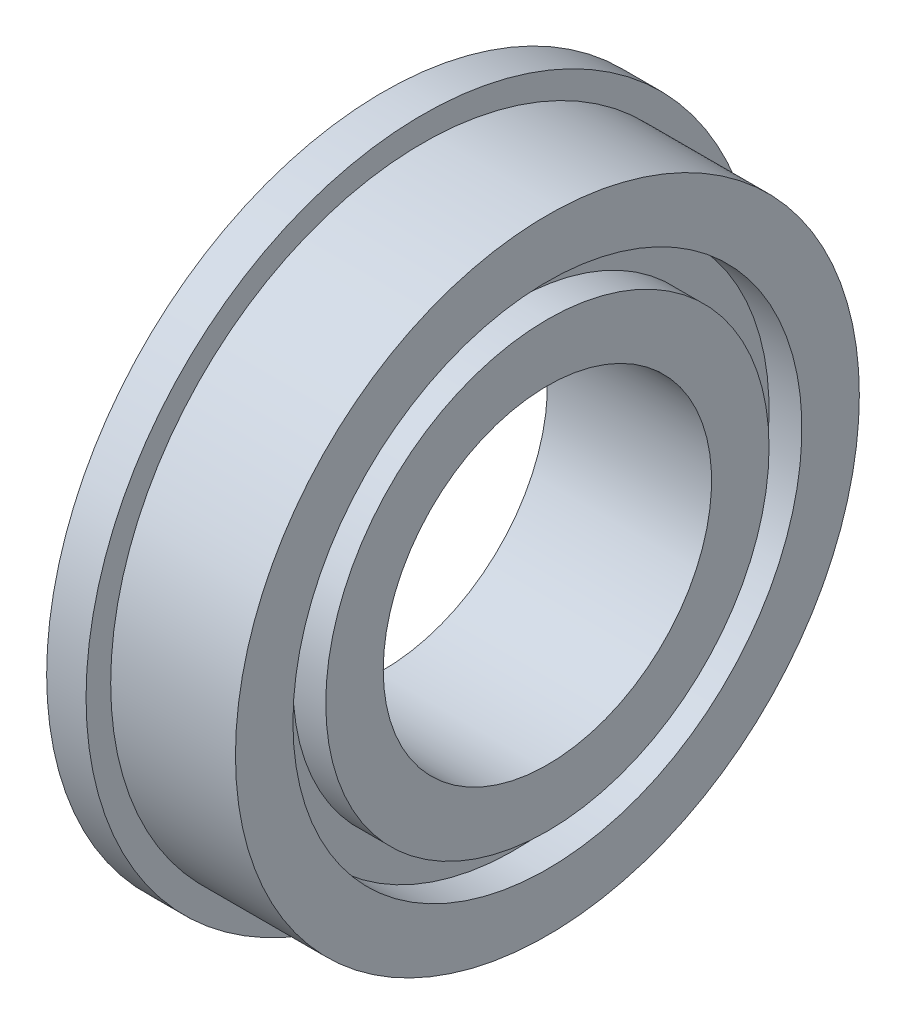
ISO-10303-21;
HEADER;
FILE_DESCRIPTION(('STEP AP214'),'2;1');
FILE_NAME('part.step','',(''),(''),'','','');
FILE_SCHEMA(('AUTOMOTIVE_DESIGN { 1 0 10303 214 1 1 1 1 }'));
ENDSEC;
DATA;
#1=APPLICATION_CONTEXT('core data for automotive mechanical design processes');
#2=APPLICATION_PROTOCOL_DEFINITION('international standard','automotive_design',2000,#1);
#3=PRODUCT_CONTEXT('',#1,'mechanical');
#4=PRODUCT('Part','Part','',(#3));
#5=PRODUCT_RELATED_PRODUCT_CATEGORY('part','',(#4));
#6=PRODUCT_DEFINITION_FORMATION('','',#4);
#7=PRODUCT_DEFINITION_CONTEXT('part definition',#1,'design');
#8=PRODUCT_DEFINITION('design','',#6,#7);
#9=PRODUCT_DEFINITION_SHAPE('','',#8);
#10=(LENGTH_UNIT() NAMED_UNIT(*) SI_UNIT(.MILLI.,.METRE.));
#11=(NAMED_UNIT(*) PLANE_ANGLE_UNIT() SI_UNIT($,.RADIAN.));
#12=(NAMED_UNIT(*) SI_UNIT($,.STERADIAN.) SOLID_ANGLE_UNIT());
#13=UNCERTAINTY_MEASURE_WITH_UNIT(LENGTH_MEASURE(1.E-05),#10,'distance_accuracy_value','');
#14=(GEOMETRIC_REPRESENTATION_CONTEXT(3) GLOBAL_UNCERTAINTY_ASSIGNED_CONTEXT((#13)) GLOBAL_UNIT_ASSIGNED_CONTEXT((#10,
#11,#12)) REPRESENTATION_CONTEXT('',''));
#15=CARTESIAN_POINT('',(0.,0.,0.));
#16=DIRECTION('',(0.,0.,1.));
#17=DIRECTION('',(1.,0.,0.));
#18=AXIS2_PLACEMENT_3D('',#15,#16,#17);
#19=CARTESIAN_POINT('',(-1.2,10.25,0.));
#20=DIRECTION('',(1.,0.,0.));
#21=DIRECTION('',(0.,0.,-1.));
#22=AXIS2_PLACEMENT_3D('',#19,#20,#21);
#23=PLANE('',#22);
#24=CARTESIAN_POINT('',(-1.2,0.,0.));
#25=DIRECTION('',(-1.,0.,0.));
#26=DIRECTION('',(0.,0.,1.));
#27=AXIS2_PLACEMENT_3D('',#24,#25,#26);
#28=CIRCLE('',#27,7.75);
#29=CARTESIAN_POINT('',(-1.2,0.,7.75));
#30=VERTEX_POINT('',#29);
#31=EDGE_CURVE('E10',#30,#30,#28,.T.);
#32=ORIENTED_EDGE('',*,*,#31,.F.);
#33=EDGE_LOOP('',(#32));
#34=FACE_BOUND('',#33,.T.);
#35=CARTESIAN_POINT('',(-1.2,0.,0.));
#36=DIRECTION('',(-1.,0.,0.));
#37=DIRECTION('',(0.,0.,1.));
#38=AXIS2_PLACEMENT_3D('',#35,#36,#37);
#39=CIRCLE('',#38,10.25);
#40=CARTESIAN_POINT('',(-1.2,0.,10.25));
#41=VERTEX_POINT('',#40);
#42=EDGE_CURVE('E75',#41,#41,#39,.T.);
#43=ORIENTED_EDGE('',*,*,#42,.T.);
#44=EDGE_LOOP('',(#43));
#45=FACE_BOUND('',#44,.T.);
#46=ADVANCED_FACE('F29',(#34,#45),#23,.F.);
#47=CARTESIAN_POINT('',(0.,0.,0.));
#48=DIRECTION('',(-1.,0.,0.));
#49=DIRECTION('',(0.,0.,1.));
#50=AXIS2_PLACEMENT_3D('',#47,#48,#49);
#51=CYLINDRICAL_SURFACE('',#50,7.75);
#52=CARTESIAN_POINT('',(-0.199999999999999,0.,0.));
#53=DIRECTION('',(-1.,0.,0.));
#54=DIRECTION('',(0.,0.,1.));
#55=AXIS2_PLACEMENT_3D('',#52,#53,#54);
#56=CIRCLE('',#55,7.75);
#57=CARTESIAN_POINT('',(-0.199999999999999,0.,7.75));
#58=VERTEX_POINT('',#57);
#59=EDGE_CURVE('E35',#58,#58,#56,.T.);
#60=ORIENTED_EDGE('',*,*,#59,.F.);
#61=EDGE_LOOP('',(#60));
#62=FACE_BOUND('',#61,.T.);
#63=ORIENTED_EDGE('',*,*,#31,.T.);
#64=EDGE_LOOP('',(#63));
#65=FACE_BOUND('',#64,.T.);
#66=ADVANCED_FACE('F148',(#62,#65),#51,.F.);
#67=CARTESIAN_POINT('',(-0.199999999999999,6.75,0.));
#68=DIRECTION('',(1.,0.,0.));
#69=DIRECTION('',(0.,0.,-1.));
#70=AXIS2_PLACEMENT_3D('',#67,#68,#69);
#71=PLANE('',#70);
#72=CARTESIAN_POINT('',(-0.199999999999999,0.,0.));
#73=DIRECTION('',(-1.,0.,0.));
#74=DIRECTION('',(0.,0.,1.));
#75=AXIS2_PLACEMENT_3D('',#72,#73,#74);
#76=CIRCLE('',#75,6.75);
#77=CARTESIAN_POINT('',(-0.199999999999999,0.,6.75));
#78=VERTEX_POINT('',#77);
#79=EDGE_CURVE('E39',#78,#78,#76,.T.);
#80=ORIENTED_EDGE('',*,*,#79,.F.);
#81=EDGE_LOOP('',(#80));
#82=FACE_BOUND('',#81,.T.);
#83=ORIENTED_EDGE('',*,*,#59,.T.);
#84=EDGE_LOOP('',(#83));
#85=FACE_BOUND('',#84,.T.);
#86=ADVANCED_FACE('F143',(#82,#85),#71,.F.);
#87=CARTESIAN_POINT('',(0.,0.,0.));
#88=DIRECTION('',(-1.,0.,0.));
#89=DIRECTION('',(0.,0.,1.));
#90=AXIS2_PLACEMENT_3D('',#87,#88,#89);
#91=CYLINDRICAL_SURFACE('',#90,6.75);
#92=CARTESIAN_POINT('',(-1.2,0.,0.));
#93=DIRECTION('',(-1.,0.,0.));
#94=DIRECTION('',(0.,0.,1.));
#95=AXIS2_PLACEMENT_3D('',#92,#93,#94);
#96=CIRCLE('',#95,6.75);
#97=CARTESIAN_POINT('',(-1.2,0.,6.75));
#98=VERTEX_POINT('',#97);
#99=EDGE_CURVE('E43',#98,#98,#96,.T.);
#100=ORIENTED_EDGE('',*,*,#99,.F.);
#101=EDGE_LOOP('',(#100));
#102=FACE_BOUND('',#101,.T.);
#103=ORIENTED_EDGE('',*,*,#79,.T.);
#104=EDGE_LOOP('',(#103));
#105=FACE_BOUND('',#104,.T.);
#106=ADVANCED_FACE('F137',(#102,#105),#91,.T.);
#107=CARTESIAN_POINT('',(-1.2,6.75,0.));
#108=DIRECTION('',(1.,0.,0.));
#109=DIRECTION('',(0.,0.,-1.));
#110=AXIS2_PLACEMENT_3D('',#107,#108,#109);
#111=PLANE('',#110);
#112=CARTESIAN_POINT('',(-1.2,0.,0.));
#113=DIRECTION('',(-1.,0.,0.));
#114=DIRECTION('',(0.,0.,1.));
#115=AXIS2_PLACEMENT_3D('',#112,#113,#114);
#116=CIRCLE('',#115,5.);
#117=CARTESIAN_POINT('',(-1.2,0.,5.));
#118=VERTEX_POINT('',#117);
#119=EDGE_CURVE('E48',#118,#118,#116,.T.);
#120=ORIENTED_EDGE('',*,*,#119,.F.);
#121=EDGE_LOOP('',(#120));
#122=FACE_BOUND('',#121,.T.);
#123=ORIENTED_EDGE('',*,*,#99,.T.);
#124=EDGE_LOOP('',(#123));
#125=FACE_BOUND('',#124,.T.);
#126=ADVANCED_FACE('F131',(#122,#125),#111,.F.);
#127=CARTESIAN_POINT('',(0.,0.,0.));
#128=DIRECTION('',(-1.,0.,0.));
#129=DIRECTION('',(0.,0.,1.));
#130=AXIS2_PLACEMENT_3D('',#127,#128,#129);
#131=CYLINDRICAL_SURFACE('',#130,5.);
#132=CARTESIAN_POINT('',(3.8,0.,0.));
#133=DIRECTION('',(-1.,0.,0.));
#134=DIRECTION('',(0.,0.,1.));
#135=AXIS2_PLACEMENT_3D('',#132,#133,#134);
#136=CIRCLE('',#135,5.);
#137=CARTESIAN_POINT('',(3.8,0.,5.));
#138=VERTEX_POINT('',#137);
#139=EDGE_CURVE('E51',#138,#138,#136,.T.);
#140=ORIENTED_EDGE('',*,*,#139,.F.);
#141=EDGE_LOOP('',(#140));
#142=FACE_BOUND('',#141,.T.);
#143=ORIENTED_EDGE('',*,*,#119,.T.);
#144=EDGE_LOOP('',(#143));
#145=FACE_BOUND('',#144,.T.);
#146=ADVANCED_FACE('F125',(#142,#145),#131,.F.);
#147=CARTESIAN_POINT('',(3.8,6.75,0.));
#148=DIRECTION('',(-1.,0.,0.));
#149=DIRECTION('',(0.,0.,1.));
#150=AXIS2_PLACEMENT_3D('',#147,#148,#149);
#151=PLANE('',#150);
#152=CARTESIAN_POINT('',(3.8,0.,0.));
#153=DIRECTION('',(-1.,0.,0.));
#154=DIRECTION('',(0.,0.,1.));
#155=AXIS2_PLACEMENT_3D('',#152,#153,#154);
#156=CIRCLE('',#155,6.75);
#157=CARTESIAN_POINT('',(3.8,0.,6.75));
#158=VERTEX_POINT('',#157);
#159=EDGE_CURVE('E54',#158,#158,#156,.T.);
#160=ORIENTED_EDGE('',*,*,#159,.F.);
#161=EDGE_LOOP('',(#160));
#162=FACE_BOUND('',#161,.T.);
#163=ORIENTED_EDGE('',*,*,#139,.T.);
#164=EDGE_LOOP('',(#163));
#165=FACE_BOUND('',#164,.T.);
#166=ADVANCED_FACE('F119',(#162,#165),#151,.F.);
#167=CARTESIAN_POINT('',(0.,0.,0.));
#168=DIRECTION('',(-1.,0.,0.));
#169=DIRECTION('',(0.,0.,1.));
#170=AXIS2_PLACEMENT_3D('',#167,#168,#169);
#171=CYLINDRICAL_SURFACE('',#170,6.75);
#172=CARTESIAN_POINT('',(2.8,0.,0.));
#173=DIRECTION('',(-1.,0.,0.));
#174=DIRECTION('',(0.,0.,1.));
#175=AXIS2_PLACEMENT_3D('',#172,#173,#174);
#176=CIRCLE('',#175,6.75);
#177=CARTESIAN_POINT('',(2.8,0.,6.75));
#178=VERTEX_POINT('',#177);
#179=EDGE_CURVE('E57',#178,#178,#176,.T.);
#180=ORIENTED_EDGE('',*,*,#179,.F.);
#181=EDGE_LOOP('',(#180));
#182=FACE_BOUND('',#181,.T.);
#183=ORIENTED_EDGE('',*,*,#159,.T.);
#184=EDGE_LOOP('',(#183));
#185=FACE_BOUND('',#184,.T.);
#186=ADVANCED_FACE('F113',(#182,#185),#171,.T.);
#187=CARTESIAN_POINT('',(2.8,7.75,0.));
#188=DIRECTION('',(-1.,0.,0.));
#189=DIRECTION('',(0.,0.,1.));
#190=AXIS2_PLACEMENT_3D('',#187,#188,#189);
#191=PLANE('',#190);
#192=CARTESIAN_POINT('',(2.8,0.,0.));
#193=DIRECTION('',(-1.,0.,0.));
#194=DIRECTION('',(0.,0.,1.));
#195=AXIS2_PLACEMENT_3D('',#192,#193,#194);
#196=CIRCLE('',#195,7.75);
#197=CARTESIAN_POINT('',(2.8,0.,7.75));
#198=VERTEX_POINT('',#197);
#199=EDGE_CURVE('E60',#198,#198,#196,.T.);
#200=ORIENTED_EDGE('',*,*,#199,.F.);
#201=EDGE_LOOP('',(#200));
#202=FACE_BOUND('',#201,.T.);
#203=ORIENTED_EDGE('',*,*,#179,.T.);
#204=EDGE_LOOP('',(#203));
#205=FACE_BOUND('',#204,.T.);
#206=ADVANCED_FACE('F107',(#202,#205),#191,.F.);
#207=CARTESIAN_POINT('',(0.,0.,0.));
#208=DIRECTION('',(-1.,0.,0.));
#209=DIRECTION('',(0.,0.,1.));
#210=AXIS2_PLACEMENT_3D('',#207,#208,#209);
#211=CYLINDRICAL_SURFACE('',#210,7.75);
#212=CARTESIAN_POINT('',(3.8,0.,0.));
#213=DIRECTION('',(-1.,0.,0.));
#214=DIRECTION('',(0.,0.,1.));
#215=AXIS2_PLACEMENT_3D('',#212,#213,#214);
#216=CIRCLE('',#215,7.75);
#217=CARTESIAN_POINT('',(3.8,0.,7.75));
#218=VERTEX_POINT('',#217);
#219=EDGE_CURVE('E63',#218,#218,#216,.T.);
#220=ORIENTED_EDGE('',*,*,#219,.F.);
#221=EDGE_LOOP('',(#220));
#222=FACE_BOUND('',#221,.T.);
#223=ORIENTED_EDGE('',*,*,#199,.T.);
#224=EDGE_LOOP('',(#223));
#225=FACE_BOUND('',#224,.T.);
#226=ADVANCED_FACE('F101',(#222,#225),#211,.F.);
#227=CARTESIAN_POINT('',(3.8,9.5,0.));
#228=DIRECTION('',(-1.,0.,0.));
#229=DIRECTION('',(0.,0.,1.));
#230=AXIS2_PLACEMENT_3D('',#227,#228,#229);
#231=PLANE('',#230);
#232=CARTESIAN_POINT('',(3.8,0.,0.));
#233=DIRECTION('',(-1.,0.,0.));
#234=DIRECTION('',(0.,0.,1.));
#235=AXIS2_PLACEMENT_3D('',#232,#233,#234);
#236=CIRCLE('',#235,9.5);
#237=CARTESIAN_POINT('',(3.8,0.,9.5));
#238=VERTEX_POINT('',#237);
#239=EDGE_CURVE('E66',#238,#238,#236,.T.);
#240=ORIENTED_EDGE('',*,*,#239,.F.);
#241=EDGE_LOOP('',(#240));
#242=FACE_BOUND('',#241,.T.);
#243=ORIENTED_EDGE('',*,*,#219,.T.);
#244=EDGE_LOOP('',(#243));
#245=FACE_BOUND('',#244,.T.);
#246=ADVANCED_FACE('F95',(#242,#245),#231,.F.);
#247=CARTESIAN_POINT('',(0.,0.,0.));
#248=DIRECTION('',(-1.,0.,0.));
#249=DIRECTION('',(0.,0.,1.));
#250=AXIS2_PLACEMENT_3D('',#247,#248,#249);
#251=CYLINDRICAL_SURFACE('',#250,9.5);
#252=CARTESIAN_POINT('',(0.,0.,0.));
#253=DIRECTION('',(-1.,0.,0.));
#254=DIRECTION('',(0.,0.,1.));
#255=AXIS2_PLACEMENT_3D('',#252,#253,#254);
#256=CIRCLE('',#255,9.5);
#257=CARTESIAN_POINT('',(0.,0.,9.5));
#258=VERTEX_POINT('',#257);
#259=EDGE_CURVE('E69',#258,#258,#256,.T.);
#260=ORIENTED_EDGE('',*,*,#259,.F.);
#261=EDGE_LOOP('',(#260));
#262=FACE_BOUND('',#261,.T.);
#263=ORIENTED_EDGE('',*,*,#239,.T.);
#264=EDGE_LOOP('',(#263));
#265=FACE_BOUND('',#264,.T.);
#266=ADVANCED_FACE('F89',(#262,#265),#251,.T.);
#267=CARTESIAN_POINT('',(0.,10.25,0.));
#268=DIRECTION('',(-1.,0.,0.));
#269=DIRECTION('',(0.,0.,1.));
#270=AXIS2_PLACEMENT_3D('',#267,#268,#269);
#271=PLANE('',#270);
#272=CARTESIAN_POINT('',(0.,0.,0.));
#273=DIRECTION('',(-1.,0.,0.));
#274=DIRECTION('',(0.,0.,1.));
#275=AXIS2_PLACEMENT_3D('',#272,#273,#274);
#276=CIRCLE('',#275,10.25);
#277=CARTESIAN_POINT('',(0.,0.,10.25));
#278=VERTEX_POINT('',#277);
#279=EDGE_CURVE('E72',#278,#278,#276,.T.);
#280=ORIENTED_EDGE('',*,*,#279,.F.);
#281=EDGE_LOOP('',(#280));
#282=FACE_BOUND('',#281,.T.);
#283=ORIENTED_EDGE('',*,*,#259,.T.);
#284=EDGE_LOOP('',(#283));
#285=FACE_BOUND('',#284,.T.);
#286=ADVANCED_FACE('F83',(#282,#285),#271,.F.);
#287=CARTESIAN_POINT('',(0.,0.,0.));
#288=DIRECTION('',(-1.,0.,0.));
#289=DIRECTION('',(0.,0.,1.));
#290=AXIS2_PLACEMENT_3D('',#287,#288,#289);
#291=CYLINDRICAL_SURFACE('',#290,10.25);
#292=ORIENTED_EDGE('',*,*,#42,.F.);
#293=EDGE_LOOP('',(#292));
#294=FACE_BOUND('',#293,.T.);
#295=ORIENTED_EDGE('',*,*,#279,.T.);
#296=EDGE_LOOP('',(#295));
#297=FACE_BOUND('',#296,.T.);
#298=ADVANCED_FACE('F80',(#294,#297),#291,.T.);
#299=CLOSED_SHELL('',(#46,#66,#86,#106,#126,#146,#166,#186,#206,#226,#246,#266,#286,#298));
#300=MANIFOLD_SOLID_BREP('B2',#299);
#301=ADVANCED_BREP_SHAPE_REPRESENTATION('',(#18,#300),#14);
#302=SHAPE_DEFINITION_REPRESENTATION(#9,#301);
ENDSEC;
END-ISO-10303-21;
